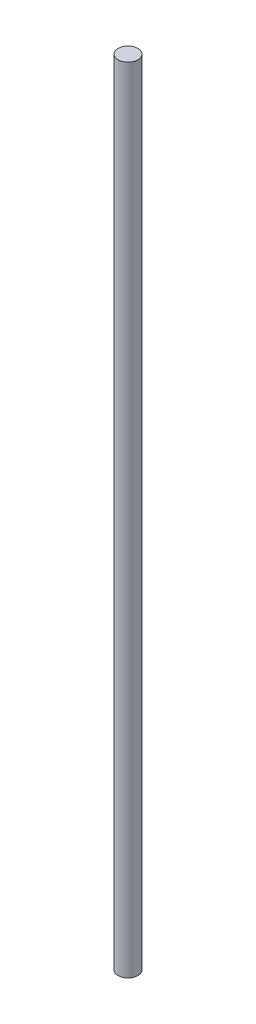
ISO-10303-21;
HEADER;
FILE_DESCRIPTION(('STEP AP214'),'2;1');
FILE_NAME('part.step','',(''),(''),'','','');
FILE_SCHEMA(('AUTOMOTIVE_DESIGN { 1 0 10303 214 1 1 1 1 }'));
ENDSEC;
DATA;
#1=APPLICATION_CONTEXT('core data for automotive mechanical design processes');
#2=APPLICATION_PROTOCOL_DEFINITION('international standard','automotive_design',2000,#1);
#3=PRODUCT_CONTEXT('',#1,'mechanical');
#4=PRODUCT('Part','Part','',(#3));
#5=PRODUCT_RELATED_PRODUCT_CATEGORY('part','',(#4));
#6=PRODUCT_DEFINITION_FORMATION('','',#4);
#7=PRODUCT_DEFINITION_CONTEXT('part definition',#1,'design');
#8=PRODUCT_DEFINITION('design','',#6,#7);
#9=PRODUCT_DEFINITION_SHAPE('','',#8);
#10=(LENGTH_UNIT() NAMED_UNIT(*) SI_UNIT(.MILLI.,.METRE.));
#11=(NAMED_UNIT(*) PLANE_ANGLE_UNIT() SI_UNIT($,.RADIAN.));
#12=(NAMED_UNIT(*) SI_UNIT($,.STERADIAN.) SOLID_ANGLE_UNIT());
#13=UNCERTAINTY_MEASURE_WITH_UNIT(LENGTH_MEASURE(1.E-05),#10,'distance_accuracy_value','');
#14=(GEOMETRIC_REPRESENTATION_CONTEXT(3) GLOBAL_UNCERTAINTY_ASSIGNED_CONTEXT((#13)) GLOBAL_UNIT_ASSIGNED_CONTEXT((#10,
#11,#12)) REPRESENTATION_CONTEXT('',''));
#15=CARTESIAN_POINT('',(0.,0.,0.));
#16=DIRECTION('',(0.,0.,1.));
#17=DIRECTION('',(1.,0.,0.));
#18=AXIS2_PLACEMENT_3D('',#15,#16,#17);
#19=CARTESIAN_POINT('',(0.,254.,0.));
#20=DIRECTION('',(0.,-1.,0.));
#21=DIRECTION('',(0.,0.,-1.));
#22=AXIS2_PLACEMENT_3D('',#19,#20,#21);
#23=CYLINDRICAL_SURFACE('',#22,3.175);
#24=CARTESIAN_POINT('',(0.,254.,0.));
#25=DIRECTION('',(0.,1.,0.));
#26=DIRECTION('',(0.,0.,1.));
#27=AXIS2_PLACEMENT_3D('',#24,#25,#26);
#28=CIRCLE('',#27,3.175);
#29=CARTESIAN_POINT('',(0.,254.,3.175));
#30=VERTEX_POINT('',#29);
#31=EDGE_CURVE('E10',#30,#30,#28,.T.);
#32=ORIENTED_EDGE('',*,*,#31,.F.);
#33=EDGE_LOOP('',(#32));
#34=FACE_BOUND('',#33,.T.);
#35=CARTESIAN_POINT('',(0.,0.,0.));
#36=DIRECTION('',(0.,1.,0.));
#37=DIRECTION('',(0.,0.,1.));
#38=AXIS2_PLACEMENT_3D('',#35,#36,#37);
#39=CIRCLE('',#38,3.175);
#40=CARTESIAN_POINT('',(0.,0.,3.175));
#41=VERTEX_POINT('',#40);
#42=EDGE_CURVE('E34',#41,#41,#39,.T.);
#43=ORIENTED_EDGE('',*,*,#42,.T.);
#44=EDGE_LOOP('',(#43));
#45=FACE_BOUND('',#44,.T.);
#46=ADVANCED_FACE('F31',(#34,#45),#23,.T.);
#47=CARTESIAN_POINT('',(0.,254.,0.));
#48=DIRECTION('',(0.,1.,0.));
#49=DIRECTION('',(0.,0.,1.));
#50=AXIS2_PLACEMENT_3D('',#47,#48,#49);
#51=PLANE('',#50);
#52=ORIENTED_EDGE('',*,*,#31,.T.);
#53=EDGE_LOOP('',(#52));
#54=FACE_BOUND('',#53,.T.);
#55=ADVANCED_FACE('F46',(#54),#51,.T.);
#56=CARTESIAN_POINT('',(0.,0.,0.));
#57=DIRECTION('',(0.,1.,0.));
#58=DIRECTION('',(0.,0.,1.));
#59=AXIS2_PLACEMENT_3D('',#56,#57,#58);
#60=PLANE('',#59);
#61=ORIENTED_EDGE('',*,*,#42,.F.);
#62=EDGE_LOOP('',(#61));
#63=FACE_BOUND('',#62,.T.);
#64=ADVANCED_FACE('F44',(#63),#60,.F.);
#65=CLOSED_SHELL('',(#46,#55,#64));
#66=MANIFOLD_SOLID_BREP('B2',#65);
#67=ADVANCED_BREP_SHAPE_REPRESENTATION('',(#18,#66),#14);
#68=SHAPE_DEFINITION_REPRESENTATION(#9,#67);
ENDSEC;
END-ISO-10303-21;
